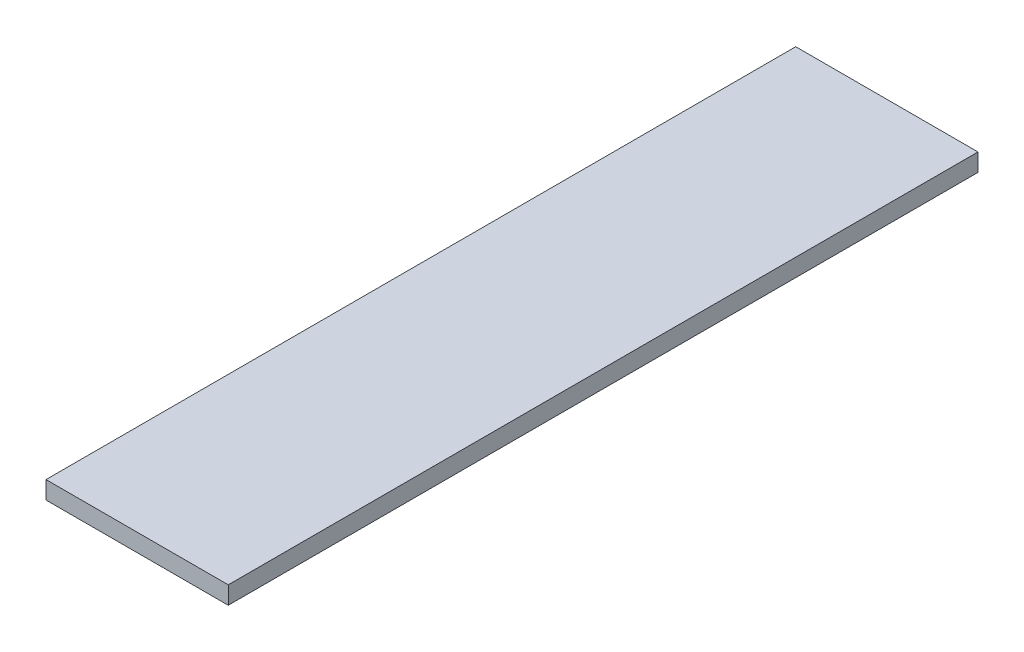
ISO-10303-21;
HEADER;
FILE_DESCRIPTION(('STEP AP214'),'2;1');
FILE_NAME('part.step','',(''),(''),'','','');
FILE_SCHEMA(('AUTOMOTIVE_DESIGN { 1 0 10303 214 1 1 1 1 }'));
ENDSEC;
DATA;
#1=APPLICATION_CONTEXT('core data for automotive mechanical design processes');
#2=APPLICATION_PROTOCOL_DEFINITION('international standard','automotive_design',2000,#1);
#3=PRODUCT_CONTEXT('',#1,'mechanical');
#4=PRODUCT('Part','Part','',(#3));
#5=PRODUCT_RELATED_PRODUCT_CATEGORY('part','',(#4));
#6=PRODUCT_DEFINITION_FORMATION('','',#4);
#7=PRODUCT_DEFINITION_CONTEXT('part definition',#1,'design');
#8=PRODUCT_DEFINITION('design','',#6,#7);
#9=PRODUCT_DEFINITION_SHAPE('','',#8);
#10=(LENGTH_UNIT() NAMED_UNIT(*) SI_UNIT(.MILLI.,.METRE.));
#11=(NAMED_UNIT(*) PLANE_ANGLE_UNIT() SI_UNIT($,.RADIAN.));
#12=(NAMED_UNIT(*) SI_UNIT($,.STERADIAN.) SOLID_ANGLE_UNIT());
#13=UNCERTAINTY_MEASURE_WITH_UNIT(LENGTH_MEASURE(1.E-05),#10,'distance_accuracy_value','');
#14=(GEOMETRIC_REPRESENTATION_CONTEXT(3) GLOBAL_UNCERTAINTY_ASSIGNED_CONTEXT((#13)) GLOBAL_UNIT_ASSIGNED_CONTEXT((#10,
#11,#12)) REPRESENTATION_CONTEXT('',''));
#15=CARTESIAN_POINT('',(0.,0.,0.));
#16=DIRECTION('',(0.,0.,1.));
#17=DIRECTION('',(1.,0.,0.));
#18=AXIS2_PLACEMENT_3D('',#15,#16,#17);
#19=CARTESIAN_POINT('',(-92.5,18.,380.5));
#20=DIRECTION('',(1.,0.,0.));
#21=DIRECTION('',(0.,0.,-1.));
#22=AXIS2_PLACEMENT_3D('',#19,#20,#21);
#23=PLANE('',#22);
#24=DIRECTION('',(0.,0.,1.));
#25=VECTOR('',#24,1.);
#26=CARTESIAN_POINT('',(-92.5,0.,380.5));
#27=LINE('',#26,#25);
#28=CARTESIAN_POINT('',(-92.5,0.,-380.5));
#29=VERTEX_POINT('',#28);
#30=CARTESIAN_POINT('',(-92.5,0.,380.5));
#31=VERTEX_POINT('',#30);
#32=EDGE_CURVE('E98',#29,#31,#27,.T.);
#33=ORIENTED_EDGE('',*,*,#32,.T.);
#34=DIRECTION('',(0.,-1.,0.));
#35=VECTOR('',#34,1.);
#36=CARTESIAN_POINT('',(-92.5,18.,380.5));
#37=LINE('',#36,#35);
#38=CARTESIAN_POINT('',(-92.5,18.,380.5));
#39=VERTEX_POINT('',#38);
#40=EDGE_CURVE('E11',#39,#31,#37,.T.);
#41=ORIENTED_EDGE('',*,*,#40,.F.);
#42=DIRECTION('',(0.,0.,1.));
#43=VECTOR('',#42,1.);
#44=CARTESIAN_POINT('',(-92.5,18.,380.5));
#45=LINE('',#44,#43);
#46=CARTESIAN_POINT('',(-92.5,18.,-380.5));
#47=VERTEX_POINT('',#46);
#48=EDGE_CURVE('E86',#47,#39,#45,.T.);
#49=ORIENTED_EDGE('',*,*,#48,.F.);
#50=DIRECTION('',(0.,-1.,0.));
#51=VECTOR('',#50,1.);
#52=CARTESIAN_POINT('',(-92.5,18.,-380.5));
#53=LINE('',#52,#51);
#54=EDGE_CURVE('E94',#47,#29,#53,.T.);
#55=ORIENTED_EDGE('',*,*,#54,.T.);
#56=EDGE_LOOP('',(#33,#41,#49,#55));
#57=FACE_BOUND('',#56,.T.);
#58=ADVANCED_FACE('F35',(#57),#23,.F.);
#59=CARTESIAN_POINT('',(92.5,18.,380.5));
#60=DIRECTION('',(0.,0.,-1.));
#61=DIRECTION('',(-1.,0.,0.));
#62=AXIS2_PLACEMENT_3D('',#59,#60,#61);
#63=PLANE('',#62);
#64=DIRECTION('',(1.,0.,0.));
#65=VECTOR('',#64,1.);
#66=CARTESIAN_POINT('',(92.5,0.,380.5));
#67=LINE('',#66,#65);
#68=CARTESIAN_POINT('',(92.5,0.,380.5));
#69=VERTEX_POINT('',#68);
#70=EDGE_CURVE('E90',#31,#69,#67,.T.);
#71=ORIENTED_EDGE('',*,*,#70,.T.);
#72=DIRECTION('',(0.,-1.,0.));
#73=VECTOR('',#72,1.);
#74=CARTESIAN_POINT('',(92.5,18.,380.5));
#75=LINE('',#74,#73);
#76=CARTESIAN_POINT('',(92.5,18.,380.5));
#77=VERTEX_POINT('',#76);
#78=EDGE_CURVE('E43',#77,#69,#75,.T.);
#79=ORIENTED_EDGE('',*,*,#78,.F.);
#80=DIRECTION('',(1.,0.,0.));
#81=VECTOR('',#80,1.);
#82=CARTESIAN_POINT('',(92.5,18.,380.5));
#83=LINE('',#82,#81);
#84=EDGE_CURVE('E81',#39,#77,#83,.T.);
#85=ORIENTED_EDGE('',*,*,#84,.F.);
#86=ORIENTED_EDGE('',*,*,#40,.T.);
#87=EDGE_LOOP('',(#71,#79,#85,#86));
#88=FACE_BOUND('',#87,.T.);
#89=ADVANCED_FACE('F89',(#88),#63,.F.);
#90=CARTESIAN_POINT('',(92.5,18.,380.5));
#91=DIRECTION('',(-1.,0.,0.));
#92=DIRECTION('',(0.,0.,1.));
#93=AXIS2_PLACEMENT_3D('',#90,#91,#92);
#94=PLANE('',#93);
#95=DIRECTION('',(0.,0.,-1.));
#96=VECTOR('',#95,1.);
#97=CARTESIAN_POINT('',(92.5,0.,380.5));
#98=LINE('',#97,#96);
#99=CARTESIAN_POINT('',(92.5,0.,-380.5));
#100=VERTEX_POINT('',#99);
#101=EDGE_CURVE('E68',#69,#100,#98,.T.);
#102=ORIENTED_EDGE('',*,*,#101,.T.);
#103=DIRECTION('',(0.,-1.,0.));
#104=VECTOR('',#103,1.);
#105=CARTESIAN_POINT('',(92.5,18.,-380.5));
#106=LINE('',#105,#104);
#107=CARTESIAN_POINT('',(92.5,18.,-380.5));
#108=VERTEX_POINT('',#107);
#109=EDGE_CURVE('E91',#108,#100,#106,.T.);
#110=ORIENTED_EDGE('',*,*,#109,.F.);
#111=DIRECTION('',(0.,0.,-1.));
#112=VECTOR('',#111,1.);
#113=CARTESIAN_POINT('',(92.5,18.,380.5));
#114=LINE('',#113,#112);
#115=EDGE_CURVE('E84',#77,#108,#114,.T.);
#116=ORIENTED_EDGE('',*,*,#115,.F.);
#117=ORIENTED_EDGE('',*,*,#78,.T.);
#118=EDGE_LOOP('',(#102,#110,#116,#117));
#119=FACE_BOUND('',#118,.T.);
#120=ADVANCED_FACE('F92',(#119),#94,.F.);
#121=CARTESIAN_POINT('',(92.5,18.,-380.5));
#122=DIRECTION('',(0.,0.,1.));
#123=DIRECTION('',(1.,0.,0.));
#124=AXIS2_PLACEMENT_3D('',#121,#122,#123);
#125=PLANE('',#124);
#126=DIRECTION('',(-1.,0.,0.));
#127=VECTOR('',#126,1.);
#128=CARTESIAN_POINT('',(92.5,0.,-380.5));
#129=LINE('',#128,#127);
#130=EDGE_CURVE('E74',#100,#29,#129,.T.);
#131=ORIENTED_EDGE('',*,*,#130,.T.);
#132=ORIENTED_EDGE('',*,*,#54,.F.);
#133=DIRECTION('',(-1.,0.,0.));
#134=VECTOR('',#133,1.);
#135=CARTESIAN_POINT('',(92.5,18.,-380.5));
#136=LINE('',#135,#134);
#137=EDGE_CURVE('E51',#108,#47,#136,.T.);
#138=ORIENTED_EDGE('',*,*,#137,.F.);
#139=ORIENTED_EDGE('',*,*,#109,.T.);
#140=EDGE_LOOP('',(#131,#132,#138,#139));
#141=FACE_BOUND('',#140,.T.);
#142=ADVANCED_FACE('F105',(#141),#125,.F.);
#143=CARTESIAN_POINT('',(0.,18.,0.));
#144=DIRECTION('',(0.,1.,0.));
#145=DIRECTION('',(0.,0.,1.));
#146=AXIS2_PLACEMENT_3D('',#143,#144,#145);
#147=PLANE('',#146);
#148=ORIENTED_EDGE('',*,*,#48,.T.);
#149=ORIENTED_EDGE('',*,*,#84,.T.);
#150=ORIENTED_EDGE('',*,*,#115,.T.);
#151=ORIENTED_EDGE('',*,*,#137,.T.);
#152=EDGE_LOOP('',(#148,#149,#150,#151));
#153=FACE_BOUND('',#152,.T.);
#154=ADVANCED_FACE('F82',(#153),#147,.T.);
#155=CARTESIAN_POINT('',(0.,0.,0.));
#156=DIRECTION('',(0.,1.,0.));
#157=DIRECTION('',(0.,0.,1.));
#158=AXIS2_PLACEMENT_3D('',#155,#156,#157);
#159=PLANE('',#158);
#160=ORIENTED_EDGE('',*,*,#32,.F.);
#161=ORIENTED_EDGE('',*,*,#130,.F.);
#162=ORIENTED_EDGE('',*,*,#101,.F.);
#163=ORIENTED_EDGE('',*,*,#70,.F.);
#164=EDGE_LOOP('',(#160,#161,#162,#163));
#165=FACE_BOUND('',#164,.T.);
#166=ADVANCED_FACE('F108',(#165),#159,.F.);
#167=CLOSED_SHELL('',(#58,#89,#120,#142,#154,#166));
#168=MANIFOLD_SOLID_BREP('B2',#167);
#169=ADVANCED_BREP_SHAPE_REPRESENTATION('',(#18,#168),#14);
#170=SHAPE_DEFINITION_REPRESENTATION(#9,#169);
ENDSEC;
END-ISO-10303-21;
